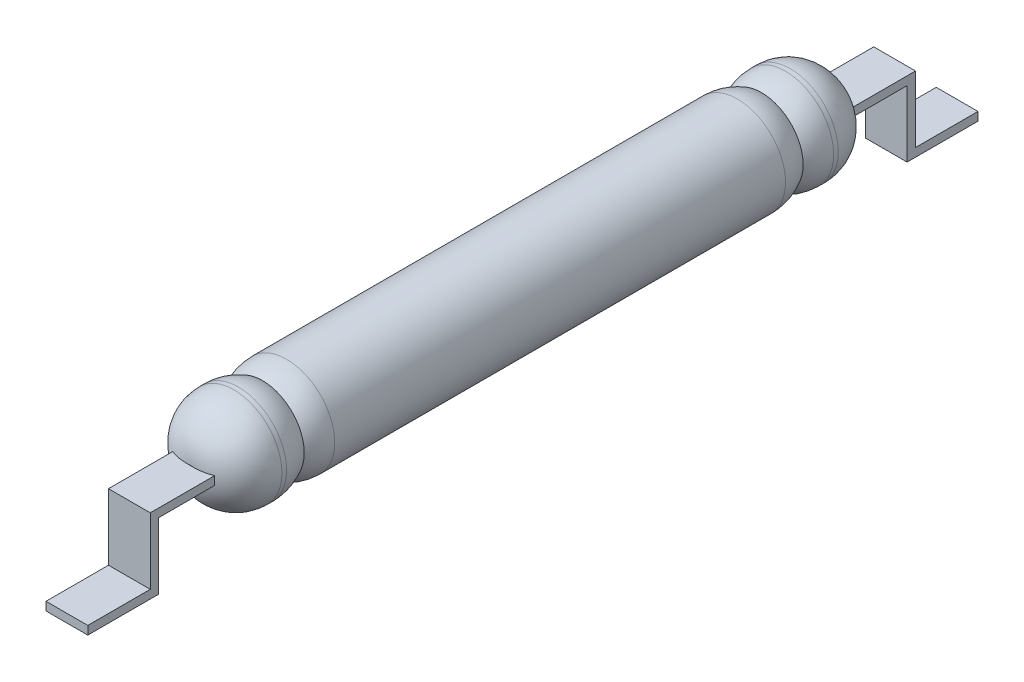
ISO-10303-21;
HEADER;
FILE_DESCRIPTION(('STEP AP214'),'2;1');
FILE_NAME('part.step','',(''),(''),'','','');
FILE_SCHEMA(('AUTOMOTIVE_DESIGN { 1 0 10303 214 1 1 1 1 }'));
ENDSEC;
DATA;
#1=APPLICATION_CONTEXT('core data for automotive mechanical design processes');
#2=APPLICATION_PROTOCOL_DEFINITION('international standard','automotive_design',2000,#1);
#3=PRODUCT_CONTEXT('',#1,'mechanical');
#4=PRODUCT('Part','Part','',(#3));
#5=PRODUCT_RELATED_PRODUCT_CATEGORY('part','',(#4));
#6=PRODUCT_DEFINITION_FORMATION('','',#4);
#7=PRODUCT_DEFINITION_CONTEXT('part definition',#1,'design');
#8=PRODUCT_DEFINITION('design','',#6,#7);
#9=PRODUCT_DEFINITION_SHAPE('','',#8);
#10=(LENGTH_UNIT() NAMED_UNIT(*) SI_UNIT(.MILLI.,.METRE.));
#11=(NAMED_UNIT(*) PLANE_ANGLE_UNIT() SI_UNIT($,.RADIAN.));
#12=(NAMED_UNIT(*) SI_UNIT($,.STERADIAN.) SOLID_ANGLE_UNIT());
#13=UNCERTAINTY_MEASURE_WITH_UNIT(LENGTH_MEASURE(1.E-05),#10,'distance_accuracy_value','');
#14=(GEOMETRIC_REPRESENTATION_CONTEXT(3) GLOBAL_UNCERTAINTY_ASSIGNED_CONTEXT((#13)) GLOBAL_UNIT_ASSIGNED_CONTEXT((#10,
#11,#12)) REPRESENTATION_CONTEXT('',''));
#15=CARTESIAN_POINT('',(0.,0.,0.));
#16=DIRECTION('',(0.,0.,1.));
#17=DIRECTION('',(1.,0.,0.));
#18=AXIS2_PLACEMENT_3D('',#15,#16,#17);
#19=CARTESIAN_POINT('',(0.,0.,15.24));
#20=DIRECTION('',(0.,0.,1.));
#21=DIRECTION('',(1.,0.,0.));
#22=AXIS2_PLACEMENT_3D('',#19,#20,#21);
#23=PLANE('',#22);
#24=DIRECTION('',(-1.,0.,0.));
#25=VECTOR('',#24,1.);
#26=CARTESIAN_POINT('',(0.,-0.10000000000292,15.24));
#27=LINE('',#26,#25);
#28=CARTESIAN_POINT('',(0.0458257569431867,-0.10000000000292,15.24));
#29=VERTEX_POINT('',#28);
#30=CARTESIAN_POINT('',(-0.0458257569431867,-0.10000000000292,15.24));
#31=VERTEX_POINT('',#30);
#32=EDGE_CURVE('E363',#29,#31,#27,.T.);
#33=ORIENTED_EDGE('',*,*,#32,.T.);
#34=CARTESIAN_POINT('',(0.,0.,15.24));
#35=DIRECTION('',(0.,0.,1.));
#36=DIRECTION('',(1.,0.,0.));
#37=AXIS2_PLACEMENT_3D('',#34,#35,#36);
#38=CIRCLE('',#37,0.11);
#39=EDGE_CURVE('E387',#31,#29,#38,.T.);
#40=ORIENTED_EDGE('',*,*,#39,.T.);
#41=EDGE_LOOP('',(#33,#40));
#42=FACE_BOUND('',#41,.T.);
#43=ADVANCED_FACE('F41',(#42),#23,.T.);
#44=CARTESIAN_POINT('',(0.,0.,0.));
#45=DIRECTION('',(0.,0.,1.));
#46=DIRECTION('',(1.,0.,0.));
#47=AXIS2_PLACEMENT_3D('',#44,#45,#46);
#48=PLANE('',#47);
#49=DIRECTION('',(1.,0.,0.));
#50=VECTOR('',#49,1.);
#51=CARTESIAN_POINT('',(-0.495,0.0999999999999999,0.));
#52=LINE('',#51,#50);
#53=CARTESIAN_POINT('',(-0.0458257569495588,0.0999999999999999,0.));
#54=VERTEX_POINT('',#53);
#55=CARTESIAN_POINT('',(0.0458257569495588,0.0999999999999999,0.));
#56=VERTEX_POINT('',#55);
#57=EDGE_CURVE('E320',#54,#56,#52,.T.);
#58=ORIENTED_EDGE('',*,*,#57,.F.);
#59=CARTESIAN_POINT('',(0.,0.,0.));
#60=DIRECTION('',(0.,0.,1.));
#61=DIRECTION('',(1.,0.,0.));
#62=AXIS2_PLACEMENT_3D('',#59,#60,#61);
#63=CIRCLE('',#62,0.11);
#64=EDGE_CURVE('E376',#54,#56,#63,.F.);
#65=ORIENTED_EDGE('',*,*,#64,.T.);
#66=EDGE_LOOP('',(#58,#65));
#67=FACE_BOUND('',#66,.T.);
#68=ADVANCED_FACE('F526',(#67),#48,.F.);
#69=DIRECTION('',(1.,0.,0.));
#70=VECTOR('',#69,1.);
#71=CARTESIAN_POINT('',(-0.495,0.0999999999999999,15.24));
#72=LINE('',#71,#70);
#73=CARTESIAN_POINT('',(-0.0458257569495588,0.0999999999999999,15.24));
#74=VERTEX_POINT('',#73);
#75=CARTESIAN_POINT('',(0.0458257569495588,0.0999999999999999,15.24));
#76=VERTEX_POINT('',#75);
#77=EDGE_CURVE('E193',#74,#76,#72,.T.);
#78=ORIENTED_EDGE('',*,*,#77,.T.);
#79=CARTESIAN_POINT('',(0.,0.,15.24));
#80=DIRECTION('',(0.,0.,1.));
#81=DIRECTION('',(1.,0.,0.));
#82=AXIS2_PLACEMENT_3D('',#79,#80,#81);
#83=CIRCLE('',#82,0.11);
#84=EDGE_CURVE('E380',#76,#74,#83,.T.);
#85=ORIENTED_EDGE('',*,*,#84,.T.);
#86=EDGE_LOOP('',(#78,#85));
#87=FACE_BOUND('',#86,.T.);
#88=ADVANCED_FACE('F528',(#87),#23,.T.);
#89=DIRECTION('',(1.,0.,0.));
#90=VECTOR('',#89,1.);
#91=CARTESIAN_POINT('',(0.,-0.10000000000292,0.));
#92=LINE('',#91,#90);
#93=CARTESIAN_POINT('',(-0.0458257569431867,-0.10000000000292,0.));
#94=VERTEX_POINT('',#93);
#95=CARTESIAN_POINT('',(0.0458257569431867,-0.10000000000292,0.));
#96=VERTEX_POINT('',#95);
#97=EDGE_CURVE('E359',#94,#96,#92,.T.);
#98=ORIENTED_EDGE('',*,*,#97,.T.);
#99=CARTESIAN_POINT('',(0.,0.,0.));
#100=DIRECTION('',(0.,0.,1.));
#101=DIRECTION('',(1.,0.,0.));
#102=AXIS2_PLACEMENT_3D('',#99,#100,#101);
#103=CIRCLE('',#102,0.11);
#104=EDGE_CURVE('E373',#96,#94,#103,.F.);
#105=ORIENTED_EDGE('',*,*,#104,.T.);
#106=EDGE_LOOP('',(#98,#105));
#107=FACE_BOUND('',#106,.T.);
#108=ADVANCED_FACE('F534',(#107),#48,.F.);
#109=CARTESIAN_POINT('',(0.,0.,15.24));
#110=DIRECTION('',(0.,0.,-1.));
#111=DIRECTION('',(-1.,0.,0.));
#112=AXIS2_PLACEMENT_3D('',#109,#110,#111);
#113=CYLINDRICAL_SURFACE('',#112,1.14);
#114=CARTESIAN_POINT('',(0.,0.,2.28));
#115=DIRECTION('',(0.,0.,1.));
#116=DIRECTION('',(1.,0.,0.));
#117=AXIS2_PLACEMENT_3D('',#114,#115,#116);
#118=CIRCLE('',#117,1.14);
#119=CARTESIAN_POINT('',(1.14,0.,2.28));
#120=VERTEX_POINT('',#119);
#121=EDGE_CURVE('E343',#120,#120,#118,.T.);
#122=ORIENTED_EDGE('',*,*,#121,.T.);
#123=EDGE_LOOP('',(#122));
#124=FACE_BOUND('',#123,.T.);
#125=CARTESIAN_POINT('',(0.,0.,12.96));
#126=DIRECTION('',(0.,0.,1.));
#127=DIRECTION('',(1.,0.,0.));
#128=AXIS2_PLACEMENT_3D('',#125,#126,#127);
#129=CIRCLE('',#128,1.14);
#130=CARTESIAN_POINT('',(1.14,0.,12.96));
#131=VERTEX_POINT('',#130);
#132=EDGE_CURVE('E355',#131,#131,#129,.T.);
#133=ORIENTED_EDGE('',*,*,#132,.F.);
#134=EDGE_LOOP('',(#133));
#135=FACE_BOUND('',#134,.T.);
#136=ADVANCED_FACE('F541',(#124,#135),#113,.T.);
#137=CARTESIAN_POINT('',(0.,0.,12.96));
#138=DIRECTION('',(0.,0.,1.));
#139=DIRECTION('',(0.,1.,0.));
#140=AXIS2_PLACEMENT_3D('',#137,#138,#139);
#141=SPHERICAL_SURFACE('',#140,1.14);
#142=ORIENTED_EDGE('',*,*,#132,.T.);
#143=EDGE_LOOP('',(#142));
#144=FACE_BOUND('',#143,.T.);
#145=CARTESIAN_POINT('',(0.,0.,13.53));
#146=DIRECTION('',(0.,0.,1.));
#147=DIRECTION('',(1.,0.,0.));
#148=AXIS2_PLACEMENT_3D('',#145,#146,#147);
#149=CIRCLE('',#148,0.98726896031426);
#150=CARTESIAN_POINT('',(0.98726896031426,0.,13.53));
#151=VERTEX_POINT('',#150);
#152=EDGE_CURVE('E347',#151,#151,#149,.T.);
#153=ORIENTED_EDGE('',*,*,#152,.F.);
#154=EDGE_LOOP('',(#153));
#155=FACE_BOUND('',#154,.T.);
#156=ADVANCED_FACE('F627',(#144,#155),#141,.T.);
#157=CARTESIAN_POINT('',(0.,0.,14.1));
#158=DIRECTION('',(0.,0.,1.));
#159=DIRECTION('',(0.,1.,0.));
#160=AXIS2_PLACEMENT_3D('',#157,#158,#159);
#161=SPHERICAL_SURFACE('',#160,1.14);
#162=ORIENTED_EDGE('',*,*,#152,.T.);
#163=EDGE_LOOP('',(#162));
#164=FACE_BOUND('',#163,.T.);
#165=CARTESIAN_POINT('',(0.,0.,14.1));
#166=DIRECTION('',(0.,0.,1.));
#167=DIRECTION('',(1.,0.,0.));
#168=AXIS2_PLACEMENT_3D('',#165,#166,#167);
#169=CIRCLE('',#168,1.14);
#170=CARTESIAN_POINT('',(1.14,0.,14.1));
#171=VERTEX_POINT('',#170);
#172=EDGE_CURVE('E351',#171,#171,#169,.T.);
#173=ORIENTED_EDGE('',*,*,#172,.F.);
#174=EDGE_LOOP('',(#173));
#175=FACE_BOUND('',#174,.T.);
#176=ADVANCED_FACE('F625',(#164,#175),#161,.T.);
#177=CARTESIAN_POINT('',(0.,0.,14.21));
#178=DIRECTION('',(0.,0.,1.));
#179=DIRECTION('',(1.,0.,0.));
#180=AXIS2_PLACEMENT_3D('',#177,#178,#179);
#181=CIRCLE('',#180,1.14);
#182=CARTESIAN_POINT('',(1.14,0.,14.21));
#183=VERTEX_POINT('',#182);
#184=EDGE_CURVE('E391',#183,#183,#181,.F.);
#185=ORIENTED_EDGE('',*,*,#184,.T.);
#186=EDGE_LOOP('',(#185));
#187=FACE_BOUND('',#186,.T.);
#188=ORIENTED_EDGE('',*,*,#172,.T.);
#189=EDGE_LOOP('',(#188));
#190=FACE_BOUND('',#189,.T.);
#191=ADVANCED_FACE('F623',(#187,#190),#113,.T.);
#192=CARTESIAN_POINT('',(0.,0.,2.28));
#193=DIRECTION('',(0.,0.,-1.));
#194=DIRECTION('',(0.,1.,0.));
#195=AXIS2_PLACEMENT_3D('',#192,#193,#194);
#196=SPHERICAL_SURFACE('',#195,1.14);
#197=ORIENTED_EDGE('',*,*,#121,.F.);
#198=EDGE_LOOP('',(#197));
#199=FACE_BOUND('',#198,.T.);
#200=CARTESIAN_POINT('',(0.,0.,1.71));
#201=DIRECTION('',(0.,0.,1.));
#202=DIRECTION('',(1.,0.,0.));
#203=AXIS2_PLACEMENT_3D('',#200,#201,#202);
#204=CIRCLE('',#203,0.98726896031426);
#205=CARTESIAN_POINT('',(0.98726896031426,0.,1.71));
#206=VERTEX_POINT('',#205);
#207=EDGE_CURVE('E335',#206,#206,#204,.T.);
#208=ORIENTED_EDGE('',*,*,#207,.T.);
#209=EDGE_LOOP('',(#208));
#210=FACE_BOUND('',#209,.T.);
#211=ADVANCED_FACE('F619',(#199,#210),#196,.T.);
#212=CARTESIAN_POINT('',(0.,0.,1.14));
#213=DIRECTION('',(0.,0.,-1.));
#214=DIRECTION('',(0.,1.,0.));
#215=AXIS2_PLACEMENT_3D('',#212,#213,#214);
#216=SPHERICAL_SURFACE('',#215,1.14);
#217=ORIENTED_EDGE('',*,*,#207,.F.);
#218=EDGE_LOOP('',(#217));
#219=FACE_BOUND('',#218,.T.);
#220=CARTESIAN_POINT('',(0.,0.,1.14));
#221=DIRECTION('',(0.,0.,1.));
#222=DIRECTION('',(1.,0.,0.));
#223=AXIS2_PLACEMENT_3D('',#220,#221,#222);
#224=CIRCLE('',#223,1.14);
#225=CARTESIAN_POINT('',(1.14,0.,1.14));
#226=VERTEX_POINT('',#225);
#227=EDGE_CURVE('E339',#226,#226,#224,.T.);
#228=ORIENTED_EDGE('',*,*,#227,.T.);
#229=EDGE_LOOP('',(#228));
#230=FACE_BOUND('',#229,.T.);
#231=ADVANCED_FACE('F607',(#219,#230),#216,.T.);
#232=CARTESIAN_POINT('',(0.,0.,1.03));
#233=DIRECTION('',(0.,0.,1.));
#234=DIRECTION('',(1.,0.,0.));
#235=AXIS2_PLACEMENT_3D('',#232,#233,#234);
#236=CIRCLE('',#235,1.14);
#237=CARTESIAN_POINT('',(1.14,0.,1.03));
#238=VERTEX_POINT('',#237);
#239=EDGE_CURVE('E372',#238,#238,#236,.T.);
#240=ORIENTED_EDGE('',*,*,#239,.T.);
#241=EDGE_LOOP('',(#240));
#242=FACE_BOUND('',#241,.T.);
#243=ORIENTED_EDGE('',*,*,#227,.F.);
#244=EDGE_LOOP('',(#243));
#245=FACE_BOUND('',#244,.T.);
#246=ADVANCED_FACE('F515',(#242,#245),#113,.T.);
#247=CARTESIAN_POINT('',(-0.495,-0.10000000000292,0.));
#248=DIRECTION('',(0.,-1.,0.));
#249=DIRECTION('',(0.,0.,-1.));
#250=AXIS2_PLACEMENT_3D('',#247,#248,#249);
#251=PLANE('',#250);
#252=ORIENTED_EDGE('',*,*,#97,.F.);
#253=CARTESIAN_POINT('',(-0.0458257569431867,-0.10000000000292,0.));
#254=CARTESIAN_POINT('',(-0.0642061285153613,-0.10000000000292,-4.24848466738042E-05));
#255=CARTESIAN_POINT('',(-0.082594087643852,-0.10000000000292,8.24750425953893E-05));
#256=CARTESIAN_POINT('',(-0.119270575435085,-0.10000000000292,0.000917001637625799));
#257=CARTESIAN_POINT('',(-0.137559171692603,-0.10000000000292,0.00162387067598794));
#258=CARTESIAN_POINT('',(-0.184646717313805,-0.10000000000292,0.00451494550772407));
#259=CARTESIAN_POINT('',(-0.213412882540628,-0.10000000000292,0.00731676415088764));
#260=CARTESIAN_POINT('',(-0.270640706165028,-0.10000000000292,0.0151996098833216));
#261=CARTESIAN_POINT('',(-0.299102275876221,-0.10000000000292,0.0202812832345166));
#262=CARTESIAN_POINT('',(-0.35591545241199,-0.10000000000292,0.0328567015859552));
#263=CARTESIAN_POINT('',(-0.384259711837219,-0.10000000000292,0.0403837890499126));
#264=CARTESIAN_POINT('',(-0.440226867258228,-0.10000000000292,0.0578015578344732));
#265=CARTESIAN_POINT('',(-0.467849411278316,-0.10000000000292,0.0676933693983404));
#266=CARTESIAN_POINT('',(-0.494999999999973,-0.10000000000292,0.0787508212883625));
#267=B_SPLINE_CURVE_WITH_KNOTS('',3,(#253,#254,#255,#256,#257,#258,#259,#260,#261,#262,#263,
#264,#265,#266),.UNSPECIFIED.,.F.,.F.,(4,2,2,2,2,2,4),(0.,0.055151214415821,0.110048184151518,
0.19666444917943,0.283305282525894,0.371180837169264,0.459098477074055),.UNSPECIFIED.);
#268=CARTESIAN_POINT('',(-0.495,-0.10000000000292,0.0787508212879265));
#269=VERTEX_POINT('',#268);
#270=EDGE_CURVE('E550',#94,#269,#267,.T.);
#271=ORIENTED_EDGE('',*,*,#270,.T.);
#272=DIRECTION('',(0.,0.,-1.));
#273=VECTOR('',#272,1.);
#274=CARTESIAN_POINT('',(-0.495,-0.10000000000292,0.));
#275=LINE('',#274,#273);
#276=CARTESIAN_POINT('',(-0.495,-0.0999999998946429,-1.24500000002678));
#277=VERTEX_POINT('',#276);
#278=EDGE_CURVE('E290',#269,#277,#275,.T.);
#279=ORIENTED_EDGE('',*,*,#278,.T.);
#280=DIRECTION('',(1.,0.,0.));
#281=VECTOR('',#280,1.);
#282=CARTESIAN_POINT('',(-0.495,-0.0999999998946429,-1.24500000002678));
#283=LINE('',#282,#281);
#284=CARTESIAN_POINT('',(0.495,-0.0999999998946429,-1.24500000002678));
#285=VERTEX_POINT('',#284);
#286=EDGE_CURVE('E316',#277,#285,#283,.T.);
#287=ORIENTED_EDGE('',*,*,#286,.T.);
#288=DIRECTION('',(0.,0.,-1.));
#289=VECTOR('',#288,1.);
#290=CARTESIAN_POINT('',(0.495,-0.10000000000292,0.));
#291=LINE('',#290,#289);
#292=CARTESIAN_POINT('',(0.495,-0.10000000000292,0.0787508212879263));
#293=VERTEX_POINT('',#292);
#294=EDGE_CURVE('E252',#293,#285,#291,.T.);
#295=ORIENTED_EDGE('',*,*,#294,.F.);
#296=CARTESIAN_POINT('',(0.495,-0.10000000000292,0.0787508212879263));
#297=CARTESIAN_POINT('',(0.467404123861952,-0.10000000000292,0.0675114722891693));
#298=CARTESIAN_POINT('',(0.439320630473185,-0.10000000000292,0.0574770542694665));
#299=CARTESIAN_POINT('',(0.382413841601586,-0.10000000000292,0.0398536863698629));
#300=CARTESIAN_POINT('',(0.353590983722856,-0.10000000000292,0.0322633244196256));
#301=CARTESIAN_POINT('',(0.295819904714422,-0.10000000000292,0.0196404969815757));
#302=CARTESIAN_POINT('',(0.266879222535061,-0.10000000000292,0.0145733717739795));
#303=CARTESIAN_POINT('',(0.208693028250985,-0.10000000000292,0.00679131863783523));
#304=CARTESIAN_POINT('',(0.179447601111298,-0.10000000000292,0.00407575194509772));
#305=CARTESIAN_POINT('',(0.13282156936529,-0.10000000000292,0.00142299324623933));
#306=CARTESIAN_POINT('',(0.115473722955016,-0.10000000000292,0.000804021053283858));
#307=CARTESIAN_POINT('',(0.0806905621525683,-0.10000000000292,7.41000624522626E-05));
#308=CARTESIAN_POINT('',(0.0632551961585911,-0.10000000000292,-3.4622123997837E-05));
#309=CARTESIAN_POINT('',(0.0458257569431868,-0.10000000000292,0.));
#310=B_SPLINE_CURVE_WITH_KNOTS('',3,(#296,#297,#298,#299,#300,#301,#302,#303,#304,#305,#306,
#307,#308,#309),.UNSPECIFIED.,.F.,.F.,(4,2,2,2,2,2,4),(0.,0.0893588040206291,0.178665887348991,
0.266709837783721,0.354729864943991,0.406798922029454,0.459094986310802),.UNSPECIFIED.);
#311=EDGE_CURVE('E553',#293,#96,#310,.T.);
#312=ORIENTED_EDGE('',*,*,#311,.T.);
#313=EDGE_LOOP('',(#252,#271,#279,#287,#295,#312));
#314=FACE_BOUND('',#313,.T.);
#315=ADVANCED_FACE('F565',(#314),#251,.T.);
#316=CARTESIAN_POINT('',(-0.495,0.,0.));
#317=DIRECTION('',(1.,0.,0.));
#318=DIRECTION('',(0.,0.,-1.));
#319=AXIS2_PLACEMENT_3D('',#316,#317,#318);
#320=PLANE('',#319);
#321=ORIENTED_EDGE('',*,*,#278,.F.);
#322=CARTESIAN_POINT('',(-0.495,-0.10000000000292,0.0787508212879265));
#323=CARTESIAN_POINT('',(-0.495,-0.0666666666513878,0.0760234380795717));
#324=CARTESIAN_POINT('',(-0.495,-0.0333333332999162,0.0746597464761348));
#325=CARTESIAN_POINT('',(-0.495,0.0333333334029124,0.0746597464790966));
#326=CARTESIAN_POINT('',(-0.495,0.0666666667542695,0.0760234380854959));
#327=CARTESIAN_POINT('',(-0.495,0.100000000105566,0.0787508212968136));
#328=B_SPLINE_CURVE_WITH_KNOTS('',3,(#322,#323,#324,#325,#326,#327),.UNSPECIFIED.,.F.,.F.,(4,2,
4),(0.,0.10008364953371,0.20016729906744),.UNSPECIFIED.);
#329=CARTESIAN_POINT('',(-0.495,0.100000000105529,0.0787508212963636));
#330=VERTEX_POINT('',#329);
#331=EDGE_CURVE('E435',#269,#330,#328,.T.);
#332=ORIENTED_EDGE('',*,*,#331,.T.);
#333=DIRECTION('',(0.,0.,1.));
#334=VECTOR('',#333,1.);
#335=CARTESIAN_POINT('',(-0.495,0.100000000105529,0.));
#336=LINE('',#335,#334);
#337=CARTESIAN_POINT('',(-0.495,0.100000000105529,-1.44500000004715));
#338=VERTEX_POINT('',#337);
#339=EDGE_CURVE('E313',#338,#330,#336,.T.);
#340=ORIENTED_EDGE('',*,*,#339,.F.);
#341=DIRECTION('',(0.,1.,0.));
#342=VECTOR('',#341,1.);
#343=CARTESIAN_POINT('',(-0.495,0.,-1.44500000004715));
#344=LINE('',#343,#342);
#345=CARTESIAN_POINT('',(-0.495,-1.47,-1.44500000004715));
#346=VERTEX_POINT('',#345);
#347=EDGE_CURVE('E309',#346,#338,#344,.T.);
#348=ORIENTED_EDGE('',*,*,#347,.F.);
#349=DIRECTION('',(0.,0.,1.));
#350=VECTOR('',#349,1.);
#351=CARTESIAN_POINT('',(-0.495,-1.47,0.));
#352=LINE('',#351,#350);
#353=CARTESIAN_POINT('',(-0.495,-1.47,-2.925));
#354=VERTEX_POINT('',#353);
#355=EDGE_CURVE('E305',#354,#346,#352,.T.);
#356=ORIENTED_EDGE('',*,*,#355,.F.);
#357=DIRECTION('',(0.,1.,0.));
#358=VECTOR('',#357,1.);
#359=CARTESIAN_POINT('',(-0.495,0.,-2.925));
#360=LINE('',#359,#358);
#361=CARTESIAN_POINT('',(-0.495,-1.67,-2.925));
#362=VERTEX_POINT('',#361);
#363=EDGE_CURVE('E301',#362,#354,#360,.T.);
#364=ORIENTED_EDGE('',*,*,#363,.F.);
#365=DIRECTION('',(0.,0.,-1.));
#366=VECTOR('',#365,1.);
#367=CARTESIAN_POINT('',(-0.495,-1.67,0.));
#368=LINE('',#367,#366);
#369=CARTESIAN_POINT('',(-0.495,-1.67,-1.24500000002678));
#370=VERTEX_POINT('',#369);
#371=EDGE_CURVE('E297',#370,#362,#368,.T.);
#372=ORIENTED_EDGE('',*,*,#371,.F.);
#373=DIRECTION('',(0.,-1.,0.));
#374=VECTOR('',#373,1.);
#375=CARTESIAN_POINT('',(-0.495,0.,-1.24500000002678));
#376=LINE('',#375,#374);
#377=EDGE_CURVE('E293',#277,#370,#376,.T.);
#378=ORIENTED_EDGE('',*,*,#377,.F.);
#379=EDGE_LOOP('',(#321,#332,#340,#348,#356,#364,#372,#378));
#380=FACE_BOUND('',#379,.T.);
#381=ADVANCED_FACE('F420',(#380),#320,.F.);
#382=CARTESIAN_POINT('',(-0.495,0.100000000105529,0.));
#383=DIRECTION('',(0.,1.,0.));
#384=DIRECTION('',(0.,0.,1.));
#385=AXIS2_PLACEMENT_3D('',#382,#383,#384);
#386=PLANE('',#385);
#387=ORIENTED_EDGE('',*,*,#339,.T.);
#388=CARTESIAN_POINT('',(-0.495,0.100000000105529,0.0787508212963636));
#389=CARTESIAN_POINT('',(-0.467404123860998,0.100000000105529,0.0675114722969848));
#390=CARTESIAN_POINT('',(-0.439320630471237,0.100000000105529,0.0574770542767508));
#391=CARTESIAN_POINT('',(-0.382413841597647,0.100000000105529,0.0398536863762273));
#392=CARTESIAN_POINT('',(-0.353590983717921,0.100000000105529,0.0322633244255969));
#393=CARTESIAN_POINT('',(-0.295819904707378,0.100000000105529,0.0196404969868066));
#394=CARTESIAN_POINT('',(-0.266879222526901,0.100000000105529,0.0145733717788711));
#395=CARTESIAN_POINT('',(-0.208693028240576,0.100000000105529,0.00679131864200698));
#396=CARTESIAN_POINT('',(-0.179447601099755,0.100000000105529,0.0040757519488904));
#397=CARTESIAN_POINT('',(-0.132821569355761,0.100000000105529,0.00142299324926476));
#398=CARTESIAN_POINT('',(-0.115473722948647,0.100000000105529,0.000804021055914861));
#399=CARTESIAN_POINT('',(-0.0806905621525588,0.100000000105529,7.41000639705083E-05));
#400=CARTESIAN_POINT('',(-0.0632551961617804,0.100000000105529,-3.46221232003608E-05));
#401=CARTESIAN_POINT('',(-0.0458257569495589,0.100000000105529,0.));
#402=B_SPLINE_CURVE_WITH_KNOTS('',3,(#388,#389,#390,#391,#392,#393,#394,#395,#396,#397,#398,
#399,#400,#401),.UNSPECIFIED.,.F.,.F.,(4,2,2,2,2,2,4),(0.,0.0893588040239699,0.178665887355515,
0.266709837793714,0.354729864957505,0.406798922033546,0.459094986305326),.UNSPECIFIED.);
#403=EDGE_CURVE('E426',#330,#54,#402,.T.);
#404=ORIENTED_EDGE('',*,*,#403,.T.);
#405=ORIENTED_EDGE('',*,*,#57,.T.);
#406=CARTESIAN_POINT('',(0.0458257569495588,0.0999999999999999,0.));
#407=CARTESIAN_POINT('',(0.0642061285217476,0.100000000067046,-4.2484845850105E-05));
#408=CARTESIAN_POINT('',(0.0825940876502399,0.100000000095085,8.24750442316913E-05));
#409=CARTESIAN_POINT('',(0.119270575441472,0.100000000115924,0.000917001640772711));
#410=CARTESIAN_POINT('',(0.137559171698986,0.100000000108886,0.00162387067983389));
#411=CARTESIAN_POINT('',(0.18464671731972,0.100000000100233,0.00451494551309133));
#412=CARTESIAN_POINT('',(0.213412882546067,0.100000000104102,0.00731676415689912));
#413=CARTESIAN_POINT('',(0.270640706169497,0.100000000106956,0.0151996098903578));
#414=CARTESIAN_POINT('',(0.299102275880197,0.100000000105939,0.020281283241932));
#415=CARTESIAN_POINT('',(0.35591545241486,0.100000000105113,0.0328567015939385));
#416=CARTESIAN_POINT('',(0.38425971183948,0.100000000105321,0.0403837890580724));
#417=CARTESIAN_POINT('',(0.440226867259326,0.100000000105737,0.0578015578428554));
#418=CARTESIAN_POINT('',(0.467849411278858,0.100000000105946,0.0676933694067715));
#419=CARTESIAN_POINT('',(0.494999999999973,0.100000000105529,0.0787508212967998));
#420=B_SPLINE_CURVE_WITH_KNOTS('',3,(#406,#407,#408,#409,#410,#411,#412,#413,#414,#415,#416,
#417,#418,#419),.UNSPECIFIED.,.F.,.F.,(4,2,2,2,2,2,4),(0.,0.0551512144158496,0.110048184151623,
0.196664449178336,0.283305282523555,0.371180837165306,0.459098477068591),.UNSPECIFIED.);
#421=CARTESIAN_POINT('',(0.495,0.100000000105529,0.0787508212963638));
#422=VERTEX_POINT('',#421);
#423=EDGE_CURVE('E395',#56,#422,#420,.T.);
#424=ORIENTED_EDGE('',*,*,#423,.T.);
#425=DIRECTION('',(0.,0.,1.));
#426=VECTOR('',#425,1.);
#427=CARTESIAN_POINT('',(0.495,0.100000000105529,0.));
#428=LINE('',#427,#426);
#429=CARTESIAN_POINT('',(0.495,0.100000000105529,-1.44500000004715));
#430=VERTEX_POINT('',#429);
#431=EDGE_CURVE('E287',#430,#422,#428,.T.);
#432=ORIENTED_EDGE('',*,*,#431,.F.);
#433=DIRECTION('',(1.,0.,0.));
#434=VECTOR('',#433,1.);
#435=CARTESIAN_POINT('',(-0.495,0.100000000105529,-1.44500000004715));
#436=LINE('',#435,#434);
#437=EDGE_CURVE('E317',#338,#430,#436,.T.);
#438=ORIENTED_EDGE('',*,*,#437,.F.);
#439=EDGE_LOOP('',(#387,#404,#405,#424,#432,#438));
#440=FACE_BOUND('',#439,.T.);
#441=ADVANCED_FACE('F414',(#440),#386,.T.);
#442=CARTESIAN_POINT('',(-0.495,0.,-1.44500000004715));
#443=DIRECTION('',(0.,0.,-1.));
#444=DIRECTION('',(-1.,0.,0.));
#445=AXIS2_PLACEMENT_3D('',#442,#443,#444);
#446=PLANE('',#445);
#447=ORIENTED_EDGE('',*,*,#437,.T.);
#448=DIRECTION('',(0.,1.,0.));
#449=VECTOR('',#448,1.);
#450=CARTESIAN_POINT('',(0.495,0.,-1.44500000004715));
#451=LINE('',#450,#449);
#452=CARTESIAN_POINT('',(0.495,-1.47,-1.44500000004715));
#453=VERTEX_POINT('',#452);
#454=EDGE_CURVE('E283',#453,#430,#451,.T.);
#455=ORIENTED_EDGE('',*,*,#454,.F.);
#456=DIRECTION('',(1.,0.,0.));
#457=VECTOR('',#456,1.);
#458=CARTESIAN_POINT('',(-0.495,-1.47,-1.44500000004715));
#459=LINE('',#458,#457);
#460=EDGE_CURVE('E321',#346,#453,#459,.T.);
#461=ORIENTED_EDGE('',*,*,#460,.F.);
#462=ORIENTED_EDGE('',*,*,#347,.T.);
#463=EDGE_LOOP('',(#447,#455,#461,#462));
#464=FACE_BOUND('',#463,.T.);
#465=ADVANCED_FACE('F419',(#464),#446,.T.);
#466=CARTESIAN_POINT('',(-0.495,-1.47,0.));
#467=DIRECTION('',(0.,1.,0.));
#468=DIRECTION('',(0.,0.,1.));
#469=AXIS2_PLACEMENT_3D('',#466,#467,#468);
#470=PLANE('',#469);
#471=ORIENTED_EDGE('',*,*,#460,.T.);
#472=DIRECTION('',(0.,0.,1.));
#473=VECTOR('',#472,1.);
#474=CARTESIAN_POINT('',(0.495,-1.47,0.));
#475=LINE('',#474,#473);
#476=CARTESIAN_POINT('',(0.495,-1.47,-2.925));
#477=VERTEX_POINT('',#476);
#478=EDGE_CURVE('E279',#477,#453,#475,.T.);
#479=ORIENTED_EDGE('',*,*,#478,.F.);
#480=DIRECTION('',(1.,0.,0.));
#481=VECTOR('',#480,1.);
#482=CARTESIAN_POINT('',(-0.495,-1.47,-2.925));
#483=LINE('',#482,#481);
#484=EDGE_CURVE('E324',#354,#477,#483,.T.);
#485=ORIENTED_EDGE('',*,*,#484,.F.);
#486=ORIENTED_EDGE('',*,*,#355,.T.);
#487=EDGE_LOOP('',(#471,#479,#485,#486));
#488=FACE_BOUND('',#487,.T.);
#489=ADVANCED_FACE('F582',(#488),#470,.T.);
#490=CARTESIAN_POINT('',(-0.495,0.,-2.925));
#491=DIRECTION('',(0.,0.,-1.));
#492=DIRECTION('',(-1.,0.,0.));
#493=AXIS2_PLACEMENT_3D('',#490,#491,#492);
#494=PLANE('',#493);
#495=ORIENTED_EDGE('',*,*,#484,.T.);
#496=DIRECTION('',(0.,1.,0.));
#497=VECTOR('',#496,1.);
#498=CARTESIAN_POINT('',(0.495,0.,-2.925));
#499=LINE('',#498,#497);
#500=CARTESIAN_POINT('',(0.495,-1.67,-2.925));
#501=VERTEX_POINT('',#500);
#502=EDGE_CURVE('E275',#501,#477,#499,.T.);
#503=ORIENTED_EDGE('',*,*,#502,.F.);
#504=DIRECTION('',(1.,0.,0.));
#505=VECTOR('',#504,1.);
#506=CARTESIAN_POINT('',(-0.495,-1.67,-2.925));
#507=LINE('',#506,#505);
#508=EDGE_CURVE('E327',#362,#501,#507,.T.);
#509=ORIENTED_EDGE('',*,*,#508,.F.);
#510=ORIENTED_EDGE('',*,*,#363,.T.);
#511=EDGE_LOOP('',(#495,#503,#509,#510));
#512=FACE_BOUND('',#511,.T.);
#513=ADVANCED_FACE('F580',(#512),#494,.T.);
#514=CARTESIAN_POINT('',(-0.495,-1.67,0.));
#515=DIRECTION('',(0.,-1.,0.));
#516=DIRECTION('',(0.,0.,-1.));
#517=AXIS2_PLACEMENT_3D('',#514,#515,#516);
#518=PLANE('',#517);
#519=ORIENTED_EDGE('',*,*,#508,.T.);
#520=DIRECTION('',(0.,0.,-1.));
#521=VECTOR('',#520,1.);
#522=CARTESIAN_POINT('',(0.495,-1.67,0.));
#523=LINE('',#522,#521);
#524=CARTESIAN_POINT('',(0.495,-1.67,-1.24500000002678));
#525=VERTEX_POINT('',#524);
#526=EDGE_CURVE('E271',#525,#501,#523,.T.);
#527=ORIENTED_EDGE('',*,*,#526,.F.);
#528=DIRECTION('',(1.,0.,0.));
#529=VECTOR('',#528,1.);
#530=CARTESIAN_POINT('',(-0.495,-1.67,-1.24500000002678));
#531=LINE('',#530,#529);
#532=EDGE_CURVE('E330',#370,#525,#531,.T.);
#533=ORIENTED_EDGE('',*,*,#532,.F.);
#534=ORIENTED_EDGE('',*,*,#371,.T.);
#535=EDGE_LOOP('',(#519,#527,#533,#534));
#536=FACE_BOUND('',#535,.T.);
#537=ADVANCED_FACE('F575',(#536),#518,.T.);
#538=CARTESIAN_POINT('',(-0.495,0.,-1.24500000002678));
#539=DIRECTION('',(0.,0.,1.));
#540=DIRECTION('',(1.,0.,0.));
#541=AXIS2_PLACEMENT_3D('',#538,#539,#540);
#542=PLANE('',#541);
#543=ORIENTED_EDGE('',*,*,#532,.T.);
#544=DIRECTION('',(0.,-1.,0.));
#545=VECTOR('',#544,1.);
#546=CARTESIAN_POINT('',(0.495,0.,-1.24500000002678));
#547=LINE('',#546,#545);
#548=EDGE_CURVE('E267',#285,#525,#547,.T.);
#549=ORIENTED_EDGE('',*,*,#548,.F.);
#550=ORIENTED_EDGE('',*,*,#286,.F.);
#551=ORIENTED_EDGE('',*,*,#377,.T.);
#552=EDGE_LOOP('',(#543,#549,#550,#551));
#553=FACE_BOUND('',#552,.T.);
#554=ADVANCED_FACE('F569',(#553),#542,.T.);
#555=CARTESIAN_POINT('',(0.495,0.,0.));
#556=DIRECTION('',(1.,0.,0.));
#557=DIRECTION('',(0.,0.,-1.));
#558=AXIS2_PLACEMENT_3D('',#555,#556,#557);
#559=PLANE('',#558);
#560=ORIENTED_EDGE('',*,*,#431,.T.);
#561=CARTESIAN_POINT('',(0.495,0.100000000105529,0.0787508212963638));
#562=CARTESIAN_POINT('',(0.495,0.0666666667542263,0.0760234380851965));
#563=CARTESIAN_POINT('',(0.495,0.0333333334028692,0.0746597464789471));
#564=CARTESIAN_POINT('',(0.495,-0.0333333332999595,0.0746597464762842));
#565=CARTESIAN_POINT('',(0.495,-0.066666666651431,0.0760234380798711));
#566=CARTESIAN_POINT('',(0.495,-0.100000000002957,0.0787508212883763));
#567=B_SPLINE_CURVE_WITH_KNOTS('',3,(#561,#562,#563,#564,#565,#566),.UNSPECIFIED.,.F.,.F.,(4,2,
4),(0.,0.100083649533712,0.20016729906744),.UNSPECIFIED.);
#568=EDGE_CURVE('E404',#422,#293,#567,.T.);
#569=ORIENTED_EDGE('',*,*,#568,.T.);
#570=ORIENTED_EDGE('',*,*,#294,.T.);
#571=ORIENTED_EDGE('',*,*,#548,.T.);
#572=ORIENTED_EDGE('',*,*,#526,.T.);
#573=ORIENTED_EDGE('',*,*,#502,.T.);
#574=ORIENTED_EDGE('',*,*,#478,.T.);
#575=ORIENTED_EDGE('',*,*,#454,.T.);
#576=EDGE_LOOP('',(#560,#569,#570,#571,#572,#573,#574,#575));
#577=FACE_BOUND('',#576,.T.);
#578=ADVANCED_FACE('F460',(#577),#559,.T.);
#579=CARTESIAN_POINT('',(-0.495,-0.10000000000292,15.24));
#580=DIRECTION('',(0.,1.,0.));
#581=DIRECTION('',(0.,0.,1.));
#582=AXIS2_PLACEMENT_3D('',#579,#580,#581);
#583=PLANE('',#582);
#584=ORIENTED_EDGE('',*,*,#32,.F.);
#585=CARTESIAN_POINT('',(0.0458257569431867,-0.10000000000292,15.24));
#586=CARTESIAN_POINT('',(0.0642061285153613,-0.10000000000292,15.2400424848467));
#587=CARTESIAN_POINT('',(0.082594087643852,-0.10000000000292,15.2399175249574));
#588=CARTESIAN_POINT('',(0.119270575435085,-0.10000000000292,15.2390829983624));
#589=CARTESIAN_POINT('',(0.137559171692603,-0.10000000000292,15.238376129324));
#590=CARTESIAN_POINT('',(0.184646717313805,-0.10000000000292,15.2354850544923));
#591=CARTESIAN_POINT('',(0.213412882540628,-0.10000000000292,15.2326832358491));
#592=CARTESIAN_POINT('',(0.270640706165028,-0.10000000000292,15.2248003901167));
#593=CARTESIAN_POINT('',(0.299102275876221,-0.10000000000292,15.2197187167655));
#594=CARTESIAN_POINT('',(0.35591545241199,-0.10000000000292,15.207143298414));
#595=CARTESIAN_POINT('',(0.384259711837219,-0.10000000000292,15.1996162109501));
#596=CARTESIAN_POINT('',(0.440226867258228,-0.10000000000292,15.1821984421655));
#597=CARTESIAN_POINT('',(0.467849411278316,-0.10000000000292,15.1723066306017));
#598=CARTESIAN_POINT('',(0.494999999999973,-0.10000000000292,15.1612491787116));
#599=B_SPLINE_CURVE_WITH_KNOTS('',3,(#585,#586,#587,#588,#589,#590,#591,#592,#593,#594,#595,
#596,#597,#598),.UNSPECIFIED.,.F.,.F.,(4,2,2,2,2,2,4),(0.,0.055151214415821,0.110048184151518,
0.19666444917943,0.283305282525894,0.371180837169263,0.459098477074055),.UNSPECIFIED.);
#600=CARTESIAN_POINT('',(0.495,-0.10000000000292,15.1612491787121));
#601=VERTEX_POINT('',#600);
#602=EDGE_CURVE('E434',#29,#601,#599,.T.);
#603=ORIENTED_EDGE('',*,*,#602,.T.);
#604=DIRECTION('',(0.,0.,1.));
#605=VECTOR('',#604,1.);
#606=CARTESIAN_POINT('',(0.495,-0.10000000000292,15.24));
#607=LINE('',#606,#605);
#608=CARTESIAN_POINT('',(0.495,-0.0999999998946429,16.4850000000268));
#609=VERTEX_POINT('',#608);
#610=EDGE_CURVE('E226',#601,#609,#607,.T.);
#611=ORIENTED_EDGE('',*,*,#610,.T.);
#612=DIRECTION('',(1.,0.,0.));
#613=VECTOR('',#612,1.);
#614=CARTESIAN_POINT('',(-0.495,-0.0999999998946429,16.4850000000268));
#615=LINE('',#614,#613);
#616=CARTESIAN_POINT('',(-0.495,-0.0999999998946429,16.4850000000268));
#617=VERTEX_POINT('',#616);
#618=EDGE_CURVE('E249',#617,#609,#615,.T.);
#619=ORIENTED_EDGE('',*,*,#618,.F.);
#620=DIRECTION('',(0.,0.,1.));
#621=VECTOR('',#620,1.);
#622=CARTESIAN_POINT('',(-0.495,-0.10000000000292,15.24));
#623=LINE('',#622,#621);
#624=CARTESIAN_POINT('',(-0.495,-0.10000000000292,15.1612491787121));
#625=VERTEX_POINT('',#624);
#626=EDGE_CURVE('E62',#625,#617,#623,.T.);
#627=ORIENTED_EDGE('',*,*,#626,.F.);
#628=CARTESIAN_POINT('',(-0.495,-0.10000000000292,15.1612491787121));
#629=CARTESIAN_POINT('',(-0.467404123861952,-0.10000000000292,15.1724885277108));
#630=CARTESIAN_POINT('',(-0.439320630473186,-0.10000000000292,15.1825229457305));
#631=CARTESIAN_POINT('',(-0.382413841601587,-0.10000000000292,15.2001463136301));
#632=CARTESIAN_POINT('',(-0.353590983722857,-0.10000000000292,15.2077366755804));
#633=CARTESIAN_POINT('',(-0.295819904714423,-0.10000000000292,15.2203595030184));
#634=CARTESIAN_POINT('',(-0.266879222535062,-0.10000000000292,15.225426628226));
#635=CARTESIAN_POINT('',(-0.208693028250986,-0.10000000000292,15.2332086813622));
#636=CARTESIAN_POINT('',(-0.179447601111299,-0.10000000000292,15.2359242480549));
#637=CARTESIAN_POINT('',(-0.13282156936529,-0.10000000000292,15.2385770067538));
#638=CARTESIAN_POINT('',(-0.115473722955016,-0.10000000000292,15.2391959789467));
#639=CARTESIAN_POINT('',(-0.0806905621525684,-0.10000000000292,15.2399258999375));
#640=CARTESIAN_POINT('',(-0.0632551961585911,-0.10000000000292,15.240034622124));
#641=CARTESIAN_POINT('',(-0.0458257569431868,-0.10000000000292,15.24));
#642=B_SPLINE_CURVE_WITH_KNOTS('',3,(#628,#629,#630,#631,#632,#633,#634,#635,#636,#637,#638,
#639,#640,#641),.UNSPECIFIED.,.F.,.F.,(4,2,2,2,2,2,4),(0.,0.0893588040206288,0.17866588734899,
0.266709837783721,0.354729864943991,0.406798922029454,0.459094986310802),.UNSPECIFIED.);
#643=EDGE_CURVE('E11',#625,#31,#642,.T.);
#644=ORIENTED_EDGE('',*,*,#643,.T.);
#645=EDGE_LOOP('',(#584,#603,#611,#619,#627,#644));
#646=FACE_BOUND('',#645,.T.);
#647=ADVANCED_FACE('F454',(#646),#583,.F.);
#648=CARTESIAN_POINT('',(-0.495,0.,16.4850000000268));
#649=DIRECTION('',(0.,0.,1.));
#650=DIRECTION('',(1.,0.,0.));
#651=AXIS2_PLACEMENT_3D('',#648,#649,#650);
#652=PLANE('',#651);
#653=ORIENTED_EDGE('',*,*,#618,.T.);
#654=DIRECTION('',(0.,-1.,0.));
#655=VECTOR('',#654,1.);
#656=CARTESIAN_POINT('',(0.495,0.,16.4850000000268));
#657=LINE('',#656,#655);
#658=CARTESIAN_POINT('',(0.495,-1.67,16.4850000000268));
#659=VERTEX_POINT('',#658);
#660=EDGE_CURVE('E222',#609,#659,#657,.T.);
#661=ORIENTED_EDGE('',*,*,#660,.T.);
#662=DIRECTION('',(1.,0.,0.));
#663=VECTOR('',#662,1.);
#664=CARTESIAN_POINT('',(-0.495,-1.67,16.4850000000268));
#665=LINE('',#664,#663);
#666=CARTESIAN_POINT('',(-0.495,-1.67,16.4850000000268));
#667=VERTEX_POINT('',#666);
#668=EDGE_CURVE('E253',#667,#659,#665,.T.);
#669=ORIENTED_EDGE('',*,*,#668,.F.);
#670=DIRECTION('',(0.,-1.,0.));
#671=VECTOR('',#670,1.);
#672=CARTESIAN_POINT('',(-0.495,0.,16.4850000000268));
#673=LINE('',#672,#671);
#674=EDGE_CURVE('E244',#617,#667,#673,.T.);
#675=ORIENTED_EDGE('',*,*,#674,.F.);
#676=EDGE_LOOP('',(#653,#661,#669,#675));
#677=FACE_BOUND('',#676,.T.);
#678=ADVANCED_FACE('F459',(#677),#652,.F.);
#679=CARTESIAN_POINT('',(-0.495,-1.67,15.24));
#680=DIRECTION('',(0.,1.,0.));
#681=DIRECTION('',(0.,0.,1.));
#682=AXIS2_PLACEMENT_3D('',#679,#680,#681);
#683=PLANE('',#682);
#684=ORIENTED_EDGE('',*,*,#668,.T.);
#685=DIRECTION('',(0.,0.,1.));
#686=VECTOR('',#685,1.);
#687=CARTESIAN_POINT('',(0.495,-1.67,15.24));
#688=LINE('',#687,#686);
#689=CARTESIAN_POINT('',(0.495,-1.67,18.165));
#690=VERTEX_POINT('',#689);
#691=EDGE_CURVE('E218',#659,#690,#688,.T.);
#692=ORIENTED_EDGE('',*,*,#691,.T.);
#693=DIRECTION('',(1.,0.,0.));
#694=VECTOR('',#693,1.);
#695=CARTESIAN_POINT('',(-0.495,-1.67,18.165));
#696=LINE('',#695,#694);
#697=CARTESIAN_POINT('',(-0.495,-1.67,18.165));
#698=VERTEX_POINT('',#697);
#699=EDGE_CURVE('E256',#698,#690,#696,.T.);
#700=ORIENTED_EDGE('',*,*,#699,.F.);
#701=DIRECTION('',(0.,0.,1.));
#702=VECTOR('',#701,1.);
#703=CARTESIAN_POINT('',(-0.495,-1.67,15.24));
#704=LINE('',#703,#702);
#705=EDGE_CURVE('E241',#667,#698,#704,.T.);
#706=ORIENTED_EDGE('',*,*,#705,.F.);
#707=EDGE_LOOP('',(#684,#692,#700,#706));
#708=FACE_BOUND('',#707,.T.);
#709=ADVANCED_FACE('F466',(#708),#683,.F.);
#710=CARTESIAN_POINT('',(-0.495,0.,18.165));
#711=DIRECTION('',(0.,0.,-1.));
#712=DIRECTION('',(-1.,0.,0.));
#713=AXIS2_PLACEMENT_3D('',#710,#711,#712);
#714=PLANE('',#713);
#715=ORIENTED_EDGE('',*,*,#699,.T.);
#716=DIRECTION('',(0.,1.,0.));
#717=VECTOR('',#716,1.);
#718=CARTESIAN_POINT('',(0.495,0.,18.165));
#719=LINE('',#718,#717);
#720=CARTESIAN_POINT('',(0.495,-1.47,18.165));
#721=VERTEX_POINT('',#720);
#722=EDGE_CURVE('E212',#690,#721,#719,.T.);
#723=ORIENTED_EDGE('',*,*,#722,.T.);
#724=DIRECTION('',(1.,0.,0.));
#725=VECTOR('',#724,1.);
#726=CARTESIAN_POINT('',(-0.495,-1.47,18.165));
#727=LINE('',#726,#725);
#728=CARTESIAN_POINT('',(-0.495,-1.47,18.165));
#729=VERTEX_POINT('',#728);
#730=EDGE_CURVE('E259',#729,#721,#727,.T.);
#731=ORIENTED_EDGE('',*,*,#730,.F.);
#732=DIRECTION('',(0.,1.,0.));
#733=VECTOR('',#732,1.);
#734=CARTESIAN_POINT('',(-0.495,0.,18.165));
#735=LINE('',#734,#733);
#736=EDGE_CURVE('E238',#698,#729,#735,.T.);
#737=ORIENTED_EDGE('',*,*,#736,.F.);
#738=EDGE_LOOP('',(#715,#723,#731,#737));
#739=FACE_BOUND('',#738,.T.);
#740=ADVANCED_FACE('F470',(#739),#714,.F.);
#741=CARTESIAN_POINT('',(-0.495,-1.47,15.24));
#742=DIRECTION('',(0.,-1.,0.));
#743=DIRECTION('',(0.,0.,-1.));
#744=AXIS2_PLACEMENT_3D('',#741,#742,#743);
#745=PLANE('',#744);
#746=ORIENTED_EDGE('',*,*,#730,.T.);
#747=DIRECTION('',(0.,0.,-1.));
#748=VECTOR('',#747,1.);
#749=CARTESIAN_POINT('',(0.495,-1.47,15.24));
#750=LINE('',#749,#748);
#751=CARTESIAN_POINT('',(0.495,-1.47,16.6850000000471));
#752=VERTEX_POINT('',#751);
#753=EDGE_CURVE('E209',#721,#752,#750,.T.);
#754=ORIENTED_EDGE('',*,*,#753,.T.);
#755=DIRECTION('',(1.,0.,0.));
#756=VECTOR('',#755,1.);
#757=CARTESIAN_POINT('',(-0.495,-1.47,16.6850000000471));
#758=LINE('',#757,#756);
#759=CARTESIAN_POINT('',(-0.495,-1.47,16.6850000000471));
#760=VERTEX_POINT('',#759);
#761=EDGE_CURVE('E192',#760,#752,#758,.T.);
#762=ORIENTED_EDGE('',*,*,#761,.F.);
#763=DIRECTION('',(0.,0.,-1.));
#764=VECTOR('',#763,1.);
#765=CARTESIAN_POINT('',(-0.495,-1.47,15.24));
#766=LINE('',#765,#764);
#767=EDGE_CURVE('E235',#729,#760,#766,.T.);
#768=ORIENTED_EDGE('',*,*,#767,.F.);
#769=EDGE_LOOP('',(#746,#754,#762,#768));
#770=FACE_BOUND('',#769,.T.);
#771=ADVANCED_FACE('F474',(#770),#745,.F.);
#772=CARTESIAN_POINT('',(-0.495,0.,16.6850000000471));
#773=DIRECTION('',(0.,0.,-1.));
#774=DIRECTION('',(-1.,0.,0.));
#775=AXIS2_PLACEMENT_3D('',#772,#773,#774);
#776=PLANE('',#775);
#777=ORIENTED_EDGE('',*,*,#761,.T.);
#778=DIRECTION('',(0.,1.,0.));
#779=VECTOR('',#778,1.);
#780=CARTESIAN_POINT('',(0.495,0.,16.6850000000471));
#781=LINE('',#780,#779);
#782=CARTESIAN_POINT('',(0.495,0.100000000105529,16.6850000000471));
#783=VERTEX_POINT('',#782);
#784=EDGE_CURVE('E199',#752,#783,#781,.T.);
#785=ORIENTED_EDGE('',*,*,#784,.T.);
#786=DIRECTION('',(1.,0.,0.));
#787=VECTOR('',#786,1.);
#788=CARTESIAN_POINT('',(-0.495,0.100000000105529,16.6850000000471));
#789=LINE('',#788,#787);
#790=CARTESIAN_POINT('',(-0.495,0.100000000105529,16.6850000000471));
#791=VERTEX_POINT('',#790);
#792=EDGE_CURVE('E183',#791,#783,#789,.T.);
#793=ORIENTED_EDGE('',*,*,#792,.F.);
#794=DIRECTION('',(0.,1.,0.));
#795=VECTOR('',#794,1.);
#796=CARTESIAN_POINT('',(-0.495,0.,16.6850000000471));
#797=LINE('',#796,#795);
#798=EDGE_CURVE('E232',#760,#791,#797,.T.);
#799=ORIENTED_EDGE('',*,*,#798,.F.);
#800=EDGE_LOOP('',(#777,#785,#793,#799));
#801=FACE_BOUND('',#800,.T.);
#802=ADVANCED_FACE('F206',(#801),#776,.F.);
#803=CARTESIAN_POINT('',(-0.495,0.100000000105529,15.24));
#804=DIRECTION('',(0.,-1.,0.));
#805=DIRECTION('',(0.,0.,-1.));
#806=AXIS2_PLACEMENT_3D('',#803,#804,#805);
#807=PLANE('',#806);
#808=ORIENTED_EDGE('',*,*,#792,.T.);
#809=DIRECTION('',(0.,0.,-1.));
#810=VECTOR('',#809,1.);
#811=CARTESIAN_POINT('',(0.495,0.100000000105529,15.24));
#812=LINE('',#811,#810);
#813=CARTESIAN_POINT('',(0.495,0.100000000105529,15.1612491787036));
#814=VERTEX_POINT('',#813);
#815=EDGE_CURVE('E186',#783,#814,#812,.T.);
#816=ORIENTED_EDGE('',*,*,#815,.T.);
#817=CARTESIAN_POINT('',(0.495,0.100000000105529,15.1612491787036));
#818=CARTESIAN_POINT('',(0.467404123860998,0.100000000105529,15.172488527703));
#819=CARTESIAN_POINT('',(0.439320630471237,0.100000000105529,15.1825229457232));
#820=CARTESIAN_POINT('',(0.382413841597647,0.100000000105529,15.2001463136238));
#821=CARTESIAN_POINT('',(0.353590983717921,0.100000000105529,15.2077366755744));
#822=CARTESIAN_POINT('',(0.295819904707378,0.100000000105529,15.2203595030132));
#823=CARTESIAN_POINT('',(0.266879222526902,0.100000000105529,15.2254266282211));
#824=CARTESIAN_POINT('',(0.208693028240576,0.100000000105529,15.233208681358));
#825=CARTESIAN_POINT('',(0.179447601099755,0.100000000105529,15.2359242480511));
#826=CARTESIAN_POINT('',(0.132821569355761,0.100000000105529,15.2385770067507));
#827=CARTESIAN_POINT('',(0.115473722948648,0.100000000105529,15.2391959789441));
#828=CARTESIAN_POINT('',(0.0806905621525589,0.100000000105529,15.239925899936));
#829=CARTESIAN_POINT('',(0.0632551961617805,0.100000000105529,15.2400346221232));
#830=CARTESIAN_POINT('',(0.0458257569495589,0.100000000105529,15.24));
#831=B_SPLINE_CURVE_WITH_KNOTS('',3,(#817,#818,#819,#820,#821,#822,#823,#824,#825,#826,#827,
#828,#829,#830),.UNSPECIFIED.,.F.,.F.,(4,2,2,2,2,2,4),(0.,0.0893588040239699,0.178665887355515,
0.266709837793714,0.354729864957505,0.406798922033545,0.459094986305326),.UNSPECIFIED.);
#832=EDGE_CURVE('E485',#814,#76,#831,.T.);
#833=ORIENTED_EDGE('',*,*,#832,.T.);
#834=ORIENTED_EDGE('',*,*,#77,.F.);
#835=CARTESIAN_POINT('',(-0.0458257569495588,0.0999999999999999,15.24));
#836=CARTESIAN_POINT('',(-0.0642061285217476,0.100000000067046,15.2400424848458));
#837=CARTESIAN_POINT('',(-0.0825940876502399,0.100000000095085,15.2399175249558));
#838=CARTESIAN_POINT('',(-0.119270575441472,0.100000000115924,15.2390829983592));
#839=CARTESIAN_POINT('',(-0.137559171698986,0.100000000108886,15.2383761293202));
#840=CARTESIAN_POINT('',(-0.18464671731972,0.100000000100233,15.2354850544869));
#841=CARTESIAN_POINT('',(-0.213412882546067,0.100000000104102,15.2326832358431));
#842=CARTESIAN_POINT('',(-0.270640706169497,0.100000000106956,15.2248003901096));
#843=CARTESIAN_POINT('',(-0.299102275880197,0.100000000105939,15.2197187167581));
#844=CARTESIAN_POINT('',(-0.355915452414861,0.100000000105113,15.2071432984061));
#845=CARTESIAN_POINT('',(-0.384259711839481,0.100000000105321,15.1996162109419));
#846=CARTESIAN_POINT('',(-0.440226867259326,0.100000000105737,15.1821984421571));
#847=CARTESIAN_POINT('',(-0.467849411278858,0.100000000105946,15.1723066305932));
#848=CARTESIAN_POINT('',(-0.494999999999973,0.100000000105529,15.1612491787032));
#849=B_SPLINE_CURVE_WITH_KNOTS('',3,(#835,#836,#837,#838,#839,#840,#841,#842,#843,#844,#845,
#846,#847,#848),.UNSPECIFIED.,.F.,.F.,(4,2,2,2,2,2,4),(0.,0.0551512144158496,0.110048184151623,
0.196664449178336,0.283305282523555,0.371180837165306,0.459098477068591),.UNSPECIFIED.);
#850=CARTESIAN_POINT('',(-0.495,0.100000000105529,15.1612491787036));
#851=VERTEX_POINT('',#850);
#852=EDGE_CURVE('E491',#74,#851,#849,.T.);
#853=ORIENTED_EDGE('',*,*,#852,.T.);
#854=DIRECTION('',(0.,0.,-1.));
#855=VECTOR('',#854,1.);
#856=CARTESIAN_POINT('',(-0.495,0.100000000105529,15.24));
#857=LINE('',#856,#855);
#858=EDGE_CURVE('E69',#791,#851,#857,.T.);
#859=ORIENTED_EDGE('',*,*,#858,.F.);
#860=EDGE_LOOP('',(#808,#816,#833,#834,#853,#859));
#861=FACE_BOUND('',#860,.T.);
#862=ADVANCED_FACE('F185',(#861),#807,.F.);
#863=CARTESIAN_POINT('',(-0.495,0.,15.24));
#864=DIRECTION('',(1.,0.,0.));
#865=DIRECTION('',(0.,0.,1.));
#866=AXIS2_PLACEMENT_3D('',#863,#864,#865);
#867=PLANE('',#866);
#868=ORIENTED_EDGE('',*,*,#858,.T.);
#869=CARTESIAN_POINT('',(-0.495,0.100000000105529,15.1612491787036));
#870=CARTESIAN_POINT('',(-0.495,0.0666666667542263,15.1639765619148));
#871=CARTESIAN_POINT('',(-0.495,0.0333333334028692,15.1653402535211));
#872=CARTESIAN_POINT('',(-0.495,-0.0333333332999595,15.1653402535237));
#873=CARTESIAN_POINT('',(-0.495,-0.066666666651431,15.1639765619201));
#874=CARTESIAN_POINT('',(-0.495,-0.100000000002957,15.1612491787116));
#875=B_SPLINE_CURVE_WITH_KNOTS('',3,(#869,#870,#871,#872,#873,#874),.UNSPECIFIED.,.F.,.F.,(4,2,
4),(0.,0.100083649533712,0.20016729906744),.UNSPECIFIED.);
#876=EDGE_CURVE('E56',#851,#625,#875,.T.);
#877=ORIENTED_EDGE('',*,*,#876,.T.);
#878=ORIENTED_EDGE('',*,*,#626,.T.);
#879=ORIENTED_EDGE('',*,*,#674,.T.);
#880=ORIENTED_EDGE('',*,*,#705,.T.);
#881=ORIENTED_EDGE('',*,*,#736,.T.);
#882=ORIENTED_EDGE('',*,*,#767,.T.);
#883=ORIENTED_EDGE('',*,*,#798,.T.);
#884=EDGE_LOOP('',(#868,#877,#878,#879,#880,#881,#882,#883));
#885=FACE_BOUND('',#884,.T.);
#886=ADVANCED_FACE('F461',(#885),#867,.F.);
#887=CARTESIAN_POINT('',(0.495,0.,15.24));
#888=DIRECTION('',(1.,0.,0.));
#889=DIRECTION('',(0.,0.,1.));
#890=AXIS2_PLACEMENT_3D('',#887,#888,#889);
#891=PLANE('',#890);
#892=ORIENTED_EDGE('',*,*,#610,.F.);
#893=CARTESIAN_POINT('',(0.495,-0.10000000000292,15.1612491787121));
#894=CARTESIAN_POINT('',(0.495,-0.0666666666513878,15.1639765619204));
#895=CARTESIAN_POINT('',(0.495,-0.0333333332999162,15.1653402535239));
#896=CARTESIAN_POINT('',(0.495,0.0333333334029125,15.1653402535209));
#897=CARTESIAN_POINT('',(0.495,0.0666666667542696,15.1639765619145));
#898=CARTESIAN_POINT('',(0.495,0.100000000105566,15.1612491787032));
#899=B_SPLINE_CURVE_WITH_KNOTS('',3,(#893,#894,#895,#896,#897,#898),.UNSPECIFIED.,.F.,.F.,(4,2,
4),(0.,0.10008364953371,0.20016729906744),.UNSPECIFIED.);
#900=EDGE_CURVE('E202',#601,#814,#899,.T.);
#901=ORIENTED_EDGE('',*,*,#900,.T.);
#902=ORIENTED_EDGE('',*,*,#815,.F.);
#903=ORIENTED_EDGE('',*,*,#784,.F.);
#904=ORIENTED_EDGE('',*,*,#753,.F.);
#905=ORIENTED_EDGE('',*,*,#722,.F.);
#906=ORIENTED_EDGE('',*,*,#691,.F.);
#907=ORIENTED_EDGE('',*,*,#660,.F.);
#908=EDGE_LOOP('',(#892,#901,#902,#903,#904,#905,#906,#907));
#909=FACE_BOUND('',#908,.T.);
#910=ADVANCED_FACE('F197',(#909),#891,.T.);
#911=CARTESIAN_POINT('',(0.,0.,1.03));
#912=DIRECTION('',(0.,0.,1.));
#913=DIRECTION('',(1.,0.,0.));
#914=AXIS2_PLACEMENT_3D('',#911,#912,#913);
#915=DEGENERATE_TOROIDAL_SURFACE('',#914,0.11,1.03,.T.);
#916=ORIENTED_EDGE('',*,*,#423,.F.);
#917=ORIENTED_EDGE('',*,*,#64,.F.);
#918=ORIENTED_EDGE('',*,*,#403,.F.);
#919=ORIENTED_EDGE('',*,*,#331,.F.);
#920=ORIENTED_EDGE('',*,*,#270,.F.);
#921=ORIENTED_EDGE('',*,*,#104,.F.);
#922=ORIENTED_EDGE('',*,*,#311,.F.);
#923=ORIENTED_EDGE('',*,*,#568,.F.);
#924=EDGE_LOOP('',(#916,#917,#918,#919,#920,#921,#922,#923));
#925=FACE_BOUND('',#924,.T.);
#926=ORIENTED_EDGE('',*,*,#239,.F.);
#927=EDGE_LOOP('',(#926));
#928=FACE_BOUND('',#927,.T.);
#929=ADVANCED_FACE('F411',(#925,#928),#915,.T.);
#930=CARTESIAN_POINT('',(0.,0.,14.21));
#931=DIRECTION('',(0.,0.,1.));
#932=DIRECTION('',(1.,0.,0.));
#933=AXIS2_PLACEMENT_3D('',#930,#931,#932);
#934=DEGENERATE_TOROIDAL_SURFACE('',#933,0.11,1.03,.T.);
#935=ORIENTED_EDGE('',*,*,#184,.F.);
#936=EDGE_LOOP('',(#935));
#937=FACE_BOUND('',#936,.T.);
#938=ORIENTED_EDGE('',*,*,#602,.F.);
#939=ORIENTED_EDGE('',*,*,#39,.F.);
#940=ORIENTED_EDGE('',*,*,#643,.F.);
#941=ORIENTED_EDGE('',*,*,#876,.F.);
#942=ORIENTED_EDGE('',*,*,#852,.F.);
#943=ORIENTED_EDGE('',*,*,#84,.F.);
#944=ORIENTED_EDGE('',*,*,#832,.F.);
#945=ORIENTED_EDGE('',*,*,#900,.F.);
#946=EDGE_LOOP('',(#938,#939,#940,#941,#942,#943,#944,#945));
#947=FACE_BOUND('',#946,.T.);
#948=ADVANCED_FACE('F43',(#937,#947),#934,.T.);
#949=CLOSED_SHELL('',(#43,#68,#88,#108,#136,#156,#176,#191,#211,#231,#246,#315,#381,#441,#465,
#489,#513,#537,#554,#578,#647,#678,#709,#740,#771,#802,#862,#886,#910,#929,#948));
#950=MANIFOLD_SOLID_BREP('B2',#949);
#951=ADVANCED_BREP_SHAPE_REPRESENTATION('',(#18,#950),#14);
#952=SHAPE_DEFINITION_REPRESENTATION(#9,#951);
ENDSEC;
END-ISO-10303-21;
